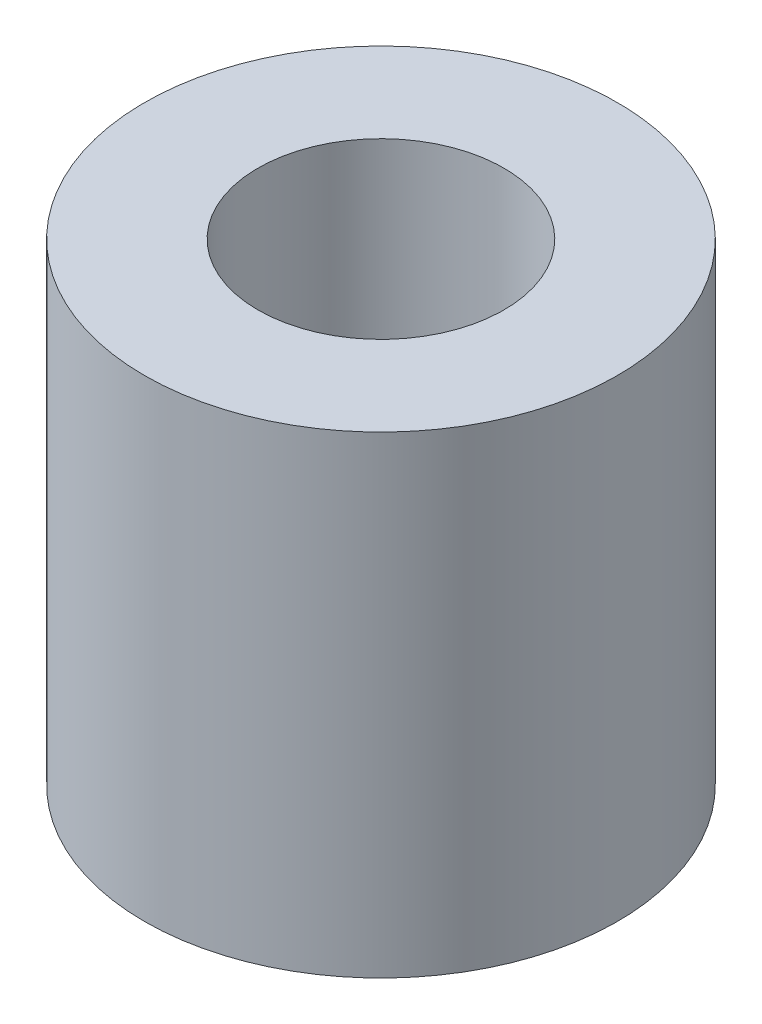
ISO-10303-21;
HEADER;
FILE_DESCRIPTION(('STEP AP214'),'2;1');
FILE_NAME('part.step','',(''),(''),'','','');
FILE_SCHEMA(('AUTOMOTIVE_DESIGN { 1 0 10303 214 1 1 1 1 }'));
ENDSEC;
DATA;
#1=APPLICATION_CONTEXT('core data for automotive mechanical design processes');
#2=APPLICATION_PROTOCOL_DEFINITION('international standard','automotive_design',2000,#1);
#3=PRODUCT_CONTEXT('',#1,'mechanical');
#4=PRODUCT('Part','Part','',(#3));
#5=PRODUCT_RELATED_PRODUCT_CATEGORY('part','',(#4));
#6=PRODUCT_DEFINITION_FORMATION('','',#4);
#7=PRODUCT_DEFINITION_CONTEXT('part definition',#1,'design');
#8=PRODUCT_DEFINITION('design','',#6,#7);
#9=PRODUCT_DEFINITION_SHAPE('','',#8);
#10=(LENGTH_UNIT() NAMED_UNIT(*) SI_UNIT(.MILLI.,.METRE.));
#11=(NAMED_UNIT(*) PLANE_ANGLE_UNIT() SI_UNIT($,.RADIAN.));
#12=(NAMED_UNIT(*) SI_UNIT($,.STERADIAN.) SOLID_ANGLE_UNIT());
#13=UNCERTAINTY_MEASURE_WITH_UNIT(LENGTH_MEASURE(1.E-05),#10,'distance_accuracy_value','');
#14=(GEOMETRIC_REPRESENTATION_CONTEXT(3) GLOBAL_UNCERTAINTY_ASSIGNED_CONTEXT((#13)) GLOBAL_UNIT_ASSIGNED_CONTEXT((#10,
#11,#12)) REPRESENTATION_CONTEXT('',''));
#15=CARTESIAN_POINT('',(0.,0.,0.));
#16=DIRECTION('',(0.,0.,1.));
#17=DIRECTION('',(1.,0.,0.));
#18=AXIS2_PLACEMENT_3D('',#15,#16,#17);
#19=CARTESIAN_POINT('',(0.,10.,0.));
#20=DIRECTION('',(0.,1.,0.));
#21=DIRECTION('',(0.,0.,1.));
#22=AXIS2_PLACEMENT_3D('',#19,#20,#21);
#23=PLANE('',#22);
#24=CARTESIAN_POINT('',(0.,10.,0.));
#25=DIRECTION('',(0.,1.,0.));
#26=DIRECTION('',(0.,0.,1.));
#27=AXIS2_PLACEMENT_3D('',#24,#25,#26);
#28=CIRCLE('',#27,5.);
#29=CARTESIAN_POINT('',(0.,10.,5.));
#30=VERTEX_POINT('',#29);
#31=EDGE_CURVE('E10',#30,#30,#28,.T.);
#32=ORIENTED_EDGE('',*,*,#31,.T.);
#33=EDGE_LOOP('',(#32));
#34=FACE_BOUND('',#33,.T.);
#35=CARTESIAN_POINT('',(0.,10.,0.));
#36=DIRECTION('',(0.,1.,0.));
#37=DIRECTION('',(0.,0.,1.));
#38=AXIS2_PLACEMENT_3D('',#35,#36,#37);
#39=CIRCLE('',#38,2.6);
#40=CARTESIAN_POINT('',(0.,10.,2.6));
#41=VERTEX_POINT('',#40);
#42=EDGE_CURVE('E44',#41,#41,#39,.T.);
#43=ORIENTED_EDGE('',*,*,#42,.F.);
#44=EDGE_LOOP('',(#43));
#45=FACE_BOUND('',#44,.T.);
#46=ADVANCED_FACE('F33',(#34,#45),#23,.T.);
#47=CARTESIAN_POINT('',(0.,0.,0.));
#48=DIRECTION('',(0.,1.,0.));
#49=DIRECTION('',(0.,0.,1.));
#50=AXIS2_PLACEMENT_3D('',#47,#48,#49);
#51=PLANE('',#50);
#52=CARTESIAN_POINT('',(0.,0.,0.));
#53=DIRECTION('',(0.,1.,0.));
#54=DIRECTION('',(0.,0.,1.));
#55=AXIS2_PLACEMENT_3D('',#52,#53,#54);
#56=CIRCLE('',#55,5.);
#57=CARTESIAN_POINT('',(0.,0.,5.));
#58=VERTEX_POINT('',#57);
#59=EDGE_CURVE('E37',#58,#58,#56,.T.);
#60=ORIENTED_EDGE('',*,*,#59,.F.);
#61=EDGE_LOOP('',(#60));
#62=FACE_BOUND('',#61,.T.);
#63=CARTESIAN_POINT('',(0.,0.,0.));
#64=DIRECTION('',(0.,1.,0.));
#65=DIRECTION('',(0.,0.,1.));
#66=AXIS2_PLACEMENT_3D('',#63,#64,#65);
#67=CIRCLE('',#66,2.6);
#68=CARTESIAN_POINT('',(0.,0.,2.6));
#69=VERTEX_POINT('',#68);
#70=EDGE_CURVE('E46',#69,#69,#67,.T.);
#71=ORIENTED_EDGE('',*,*,#70,.T.);
#72=EDGE_LOOP('',(#71));
#73=FACE_BOUND('',#72,.T.);
#74=ADVANCED_FACE('F56',(#62,#73),#51,.F.);
#75=CARTESIAN_POINT('',(0.,10.,0.));
#76=DIRECTION('',(0.,-1.,0.));
#77=DIRECTION('',(0.,0.,-1.));
#78=AXIS2_PLACEMENT_3D('',#75,#76,#77);
#79=CYLINDRICAL_SURFACE('',#78,5.);
#80=ORIENTED_EDGE('',*,*,#31,.F.);
#81=EDGE_LOOP('',(#80));
#82=FACE_BOUND('',#81,.T.);
#83=ORIENTED_EDGE('',*,*,#59,.T.);
#84=EDGE_LOOP('',(#83));
#85=FACE_BOUND('',#84,.T.);
#86=ADVANCED_FACE('F35',(#82,#85),#79,.T.);
#87=CARTESIAN_POINT('',(0.,10.,0.));
#88=DIRECTION('',(0.,-1.,0.));
#89=DIRECTION('',(0.,0.,-1.));
#90=AXIS2_PLACEMENT_3D('',#87,#88,#89);
#91=CYLINDRICAL_SURFACE('',#90,2.6);
#92=ORIENTED_EDGE('',*,*,#42,.T.);
#93=EDGE_LOOP('',(#92));
#94=FACE_BOUND('',#93,.T.);
#95=ORIENTED_EDGE('',*,*,#70,.F.);
#96=EDGE_LOOP('',(#95));
#97=FACE_BOUND('',#96,.T.);
#98=ADVANCED_FACE('F52',(#94,#97),#91,.F.);
#99=CLOSED_SHELL('',(#46,#74,#86,#98));
#100=MANIFOLD_SOLID_BREP('B2',#99);
#101=ADVANCED_BREP_SHAPE_REPRESENTATION('',(#18,#100),#14);
#102=SHAPE_DEFINITION_REPRESENTATION(#9,#101);
ENDSEC;
END-ISO-10303-21;
